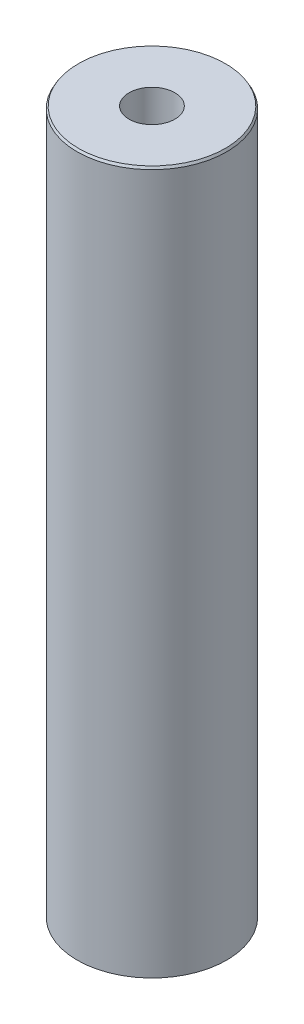
ISO-10303-21;
HEADER;
FILE_DESCRIPTION(('STEP AP214'),'2;1');
FILE_NAME('part.step','',(''),(''),'','','');
FILE_SCHEMA(('AUTOMOTIVE_DESIGN { 1 0 10303 214 1 1 1 1 }'));
ENDSEC;
DATA;
#1=APPLICATION_CONTEXT('core data for automotive mechanical design processes');
#2=APPLICATION_PROTOCOL_DEFINITION('international standard','automotive_design',2000,#1);
#3=PRODUCT_CONTEXT('',#1,'mechanical');
#4=PRODUCT('Part','Part','',(#3));
#5=PRODUCT_RELATED_PRODUCT_CATEGORY('part','',(#4));
#6=PRODUCT_DEFINITION_FORMATION('','',#4);
#7=PRODUCT_DEFINITION_CONTEXT('part definition',#1,'design');
#8=PRODUCT_DEFINITION('design','',#6,#7);
#9=PRODUCT_DEFINITION_SHAPE('','',#8);
#10=(LENGTH_UNIT() NAMED_UNIT(*) SI_UNIT(.MILLI.,.METRE.));
#11=(NAMED_UNIT(*) PLANE_ANGLE_UNIT() SI_UNIT($,.RADIAN.));
#12=(NAMED_UNIT(*) SI_UNIT($,.STERADIAN.) SOLID_ANGLE_UNIT());
#13=UNCERTAINTY_MEASURE_WITH_UNIT(LENGTH_MEASURE(1.E-05),#10,'distance_accuracy_value','');
#14=(GEOMETRIC_REPRESENTATION_CONTEXT(3) GLOBAL_UNCERTAINTY_ASSIGNED_CONTEXT((#13)) GLOBAL_UNIT_ASSIGNED_CONTEXT((#10,
#11,#12)) REPRESENTATION_CONTEXT('',''));
#15=CARTESIAN_POINT('',(0.,0.,0.));
#16=DIRECTION('',(0.,0.,1.));
#17=DIRECTION('',(1.,0.,0.));
#18=AXIS2_PLACEMENT_3D('',#15,#16,#17);
#19=CARTESIAN_POINT('',(0.,517.479813477673,0.));
#20=DIRECTION('',(0.,-1.,0.));
#21=DIRECTION('',(0.,0.,-1.));
#22=AXIS2_PLACEMENT_3D('',#19,#20,#21);
#23=CYLINDRICAL_SURFACE('',#22,55.);
#24=CARTESIAN_POINT('',(0.,515.766703068272,0.));
#25=DIRECTION('',(0.,1.,0.));
#26=DIRECTION('',(0.,0.,1.));
#27=AXIS2_PLACEMENT_3D('',#24,#25,#26);
#28=CIRCLE('',#27,55.);
#29=CARTESIAN_POINT('',(0.,515.766703068272,55.));
#30=VERTEX_POINT('',#29);
#31=EDGE_CURVE('E50',#30,#30,#28,.F.);
#32=ORIENTED_EDGE('',*,*,#31,.T.);
#33=EDGE_LOOP('',(#32));
#34=FACE_BOUND('',#33,.T.);
#35=CARTESIAN_POINT('',(0.,0.989064756019231,0.));
#36=DIRECTION('',(0.,1.,0.));
#37=DIRECTION('',(0.,0.,1.));
#38=AXIS2_PLACEMENT_3D('',#35,#36,#37);
#39=CIRCLE('',#38,55.);
#40=CARTESIAN_POINT('',(0.,0.989064756019231,55.));
#41=VERTEX_POINT('',#40);
#42=EDGE_CURVE('E51',#41,#41,#39,.T.);
#43=ORIENTED_EDGE('',*,*,#42,.T.);
#44=EDGE_LOOP('',(#43));
#45=FACE_BOUND('',#44,.T.);
#46=ADVANCED_FACE('F39',(#34,#45),#23,.T.);
#47=CARTESIAN_POINT('',(0.,517.479813477673,0.));
#48=DIRECTION('',(0.,1.,0.));
#49=DIRECTION('',(0.,0.,1.));
#50=AXIS2_PLACEMENT_3D('',#47,#48,#49);
#51=PLANE('',#50);
#52=CARTESIAN_POINT('',(0.,517.479813477673,0.));
#53=DIRECTION('',(0.,1.,0.));
#54=DIRECTION('',(0.,0.,1.));
#55=AXIS2_PLACEMENT_3D('',#52,#53,#54);
#56=CIRCLE('',#55,54.0109352439807);
#57=CARTESIAN_POINT('',(0.,517.479813477673,54.0109352439807));
#58=VERTEX_POINT('',#57);
#59=EDGE_CURVE('E54',#58,#58,#56,.T.);
#60=ORIENTED_EDGE('',*,*,#59,.T.);
#61=EDGE_LOOP('',(#60));
#62=FACE_BOUND('',#61,.T.);
#63=CARTESIAN_POINT('',(0.,517.479813477673,0.));
#64=DIRECTION('',(0.,1.,0.));
#65=DIRECTION('',(0.,0.,1.));
#66=AXIS2_PLACEMENT_3D('',#63,#64,#65);
#67=CIRCLE('',#66,16.853301343518);
#68=CARTESIAN_POINT('',(0.,517.479813477673,16.853301343518));
#69=VERTEX_POINT('',#68);
#70=EDGE_CURVE('E58',#69,#69,#67,.T.);
#71=ORIENTED_EDGE('',*,*,#70,.F.);
#72=EDGE_LOOP('',(#71));
#73=FACE_BOUND('',#72,.T.);
#74=ADVANCED_FACE('F69',(#62,#73),#51,.T.);
#75=CARTESIAN_POINT('',(0.,0.,0.));
#76=DIRECTION('',(0.,1.,0.));
#77=DIRECTION('',(0.,0.,1.));
#78=AXIS2_PLACEMENT_3D('',#75,#76,#77);
#79=PLANE('',#78);
#80=CARTESIAN_POINT('',(0.,0.,0.));
#81=DIRECTION('',(0.,1.,0.));
#82=DIRECTION('',(0.,0.,1.));
#83=AXIS2_PLACEMENT_3D('',#80,#81,#82);
#84=CIRCLE('',#83,53.2868895905989);
#85=CARTESIAN_POINT('',(0.,0.,53.2868895905989));
#86=VERTEX_POINT('',#85);
#87=EDGE_CURVE('E10',#86,#86,#84,.F.);
#88=ORIENTED_EDGE('',*,*,#87,.T.);
#89=EDGE_LOOP('',(#88));
#90=FACE_BOUND('',#89,.T.);
#91=CARTESIAN_POINT('',(0.,0.,0.));
#92=DIRECTION('',(0.,1.,0.));
#93=DIRECTION('',(0.,0.,1.));
#94=AXIS2_PLACEMENT_3D('',#91,#92,#93);
#95=CIRCLE('',#94,16.853301343518);
#96=CARTESIAN_POINT('',(0.,0.,16.853301343518));
#97=VERTEX_POINT('',#96);
#98=EDGE_CURVE('E63',#97,#97,#95,.T.);
#99=ORIENTED_EDGE('',*,*,#98,.T.);
#100=EDGE_LOOP('',(#99));
#101=FACE_BOUND('',#100,.T.);
#102=ADVANCED_FACE('F75',(#90,#101),#79,.F.);
#103=CARTESIAN_POINT('',(0.,517.479813477673,0.));
#104=DIRECTION('',(0.,-1.,0.));
#105=DIRECTION('',(0.,0.,-1.));
#106=AXIS2_PLACEMENT_3D('',#103,#104,#105);
#107=CYLINDRICAL_SURFACE('',#106,16.853301343518);
#108=ORIENTED_EDGE('',*,*,#70,.T.);
#109=EDGE_LOOP('',(#108));
#110=FACE_BOUND('',#109,.T.);
#111=ORIENTED_EDGE('',*,*,#98,.F.);
#112=EDGE_LOOP('',(#111));
#113=FACE_BOUND('',#112,.T.);
#114=ADVANCED_FACE('F70',(#110,#113),#107,.F.);
#115=CARTESIAN_POINT('',(0.,517.479813477673,0.));
#116=DIRECTION('',(0.,-1.,0.));
#117=DIRECTION('',(0.,0.,-1.));
#118=AXIS2_PLACEMENT_3D('',#115,#116,#117);
#119=CONICAL_SURFACE('',#118,54.0109352439807,0.523598775598296);
#120=ORIENTED_EDGE('',*,*,#31,.F.);
#121=EDGE_LOOP('',(#120));
#122=FACE_BOUND('',#121,.T.);
#123=ORIENTED_EDGE('',*,*,#59,.F.);
#124=EDGE_LOOP('',(#123));
#125=FACE_BOUND('',#124,.T.);
#126=ADVANCED_FACE('F81',(#122,#125),#119,.T.);
#127=CARTESIAN_POINT('',(0.,0.989064756019231,0.));
#128=DIRECTION('',(0.,1.,0.));
#129=DIRECTION('',(0.,0.,1.));
#130=AXIS2_PLACEMENT_3D('',#127,#128,#129);
#131=CONICAL_SURFACE('',#130,55.,1.04719755119662);
#132=ORIENTED_EDGE('',*,*,#87,.F.);
#133=EDGE_LOOP('',(#132));
#134=FACE_BOUND('',#133,.T.);
#135=ORIENTED_EDGE('',*,*,#42,.F.);
#136=EDGE_LOOP('',(#135));
#137=FACE_BOUND('',#136,.T.);
#138=ADVANCED_FACE('F45',(#134,#137),#131,.T.);
#139=CLOSED_SHELL('',(#46,#74,#102,#114,#126,#138));
#140=MANIFOLD_SOLID_BREP('B2',#139);
#141=ADVANCED_BREP_SHAPE_REPRESENTATION('',(#18,#140),#14);
#142=SHAPE_DEFINITION_REPRESENTATION(#9,#141);
ENDSEC;
END-ISO-10303-21;
